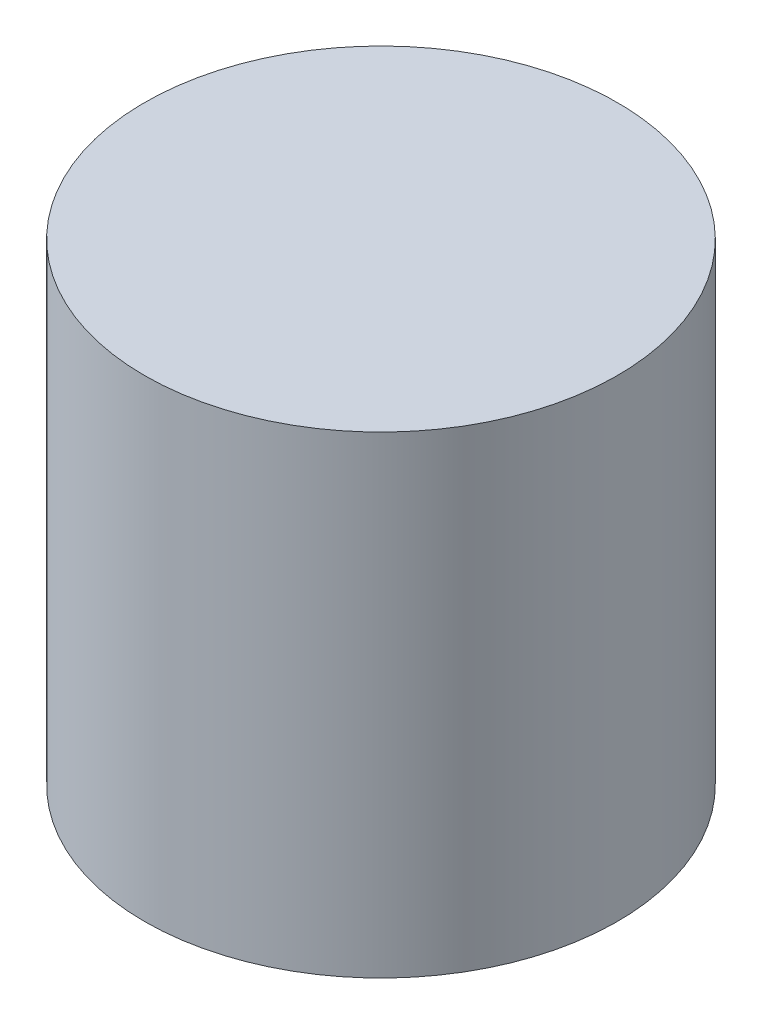
ISO-10303-21;
HEADER;
FILE_DESCRIPTION(('STEP AP214'),'2;1');
FILE_NAME('part.step','',(''),(''),'','','');
FILE_SCHEMA(('AUTOMOTIVE_DESIGN { 1 0 10303 214 1 1 1 1 }'));
ENDSEC;
DATA;
#1=APPLICATION_CONTEXT('core data for automotive mechanical design processes');
#2=APPLICATION_PROTOCOL_DEFINITION('international standard','automotive_design',2000,#1);
#3=PRODUCT_CONTEXT('',#1,'mechanical');
#4=PRODUCT('Part','Part','',(#3));
#5=PRODUCT_RELATED_PRODUCT_CATEGORY('part','',(#4));
#6=PRODUCT_DEFINITION_FORMATION('','',#4);
#7=PRODUCT_DEFINITION_CONTEXT('part definition',#1,'design');
#8=PRODUCT_DEFINITION('design','',#6,#7);
#9=PRODUCT_DEFINITION_SHAPE('','',#8);
#10=(LENGTH_UNIT() NAMED_UNIT(*) SI_UNIT(.MILLI.,.METRE.));
#11=(NAMED_UNIT(*) PLANE_ANGLE_UNIT() SI_UNIT($,.RADIAN.));
#12=(NAMED_UNIT(*) SI_UNIT($,.STERADIAN.) SOLID_ANGLE_UNIT());
#13=UNCERTAINTY_MEASURE_WITH_UNIT(LENGTH_MEASURE(1.E-05),#10,'distance_accuracy_value','');
#14=(GEOMETRIC_REPRESENTATION_CONTEXT(3) GLOBAL_UNCERTAINTY_ASSIGNED_CONTEXT((#13)) GLOBAL_UNIT_ASSIGNED_CONTEXT((#10,
#11,#12)) REPRESENTATION_CONTEXT('',''));
#15=CARTESIAN_POINT('',(0.,0.,0.));
#16=DIRECTION('',(0.,0.,1.));
#17=DIRECTION('',(1.,0.,0.));
#18=AXIS2_PLACEMENT_3D('',#15,#16,#17);
#19=CARTESIAN_POINT('',(0.,10.,0.));
#20=DIRECTION('',(0.,-1.,0.));
#21=DIRECTION('',(0.,0.,-1.));
#22=AXIS2_PLACEMENT_3D('',#19,#20,#21);
#23=CYLINDRICAL_SURFACE('',#22,5.);
#24=CARTESIAN_POINT('',(0.,10.,0.));
#25=DIRECTION('',(0.,1.,0.));
#26=DIRECTION('',(0.,0.,1.));
#27=AXIS2_PLACEMENT_3D('',#24,#25,#26);
#28=CIRCLE('',#27,5.);
#29=CARTESIAN_POINT('',(0.,10.,5.));
#30=VERTEX_POINT('',#29);
#31=EDGE_CURVE('E10',#30,#30,#28,.T.);
#32=ORIENTED_EDGE('',*,*,#31,.F.);
#33=EDGE_LOOP('',(#32));
#34=FACE_BOUND('',#33,.T.);
#35=CARTESIAN_POINT('',(0.,0.,0.));
#36=DIRECTION('',(0.,1.,0.));
#37=DIRECTION('',(0.,0.,1.));
#38=AXIS2_PLACEMENT_3D('',#35,#36,#37);
#39=CIRCLE('',#38,5.);
#40=CARTESIAN_POINT('',(0.,0.,5.));
#41=VERTEX_POINT('',#40);
#42=EDGE_CURVE('E34',#41,#41,#39,.T.);
#43=ORIENTED_EDGE('',*,*,#42,.T.);
#44=EDGE_LOOP('',(#43));
#45=FACE_BOUND('',#44,.T.);
#46=ADVANCED_FACE('F31',(#34,#45),#23,.T.);
#47=CARTESIAN_POINT('',(0.,10.,0.));
#48=DIRECTION('',(0.,1.,0.));
#49=DIRECTION('',(0.,0.,1.));
#50=AXIS2_PLACEMENT_3D('',#47,#48,#49);
#51=PLANE('',#50);
#52=ORIENTED_EDGE('',*,*,#31,.T.);
#53=EDGE_LOOP('',(#52));
#54=FACE_BOUND('',#53,.T.);
#55=ADVANCED_FACE('F46',(#54),#51,.T.);
#56=CARTESIAN_POINT('',(0.,0.,0.));
#57=DIRECTION('',(0.,1.,0.));
#58=DIRECTION('',(0.,0.,1.));
#59=AXIS2_PLACEMENT_3D('',#56,#57,#58);
#60=PLANE('',#59);
#61=ORIENTED_EDGE('',*,*,#42,.F.);
#62=EDGE_LOOP('',(#61));
#63=FACE_BOUND('',#62,.T.);
#64=ADVANCED_FACE('F44',(#63),#60,.F.);
#65=CLOSED_SHELL('',(#46,#55,#64));
#66=MANIFOLD_SOLID_BREP('B2',#65);
#67=ADVANCED_BREP_SHAPE_REPRESENTATION('',(#18,#66),#14);
#68=SHAPE_DEFINITION_REPRESENTATION(#9,#67);
ENDSEC;
END-ISO-10303-21;
